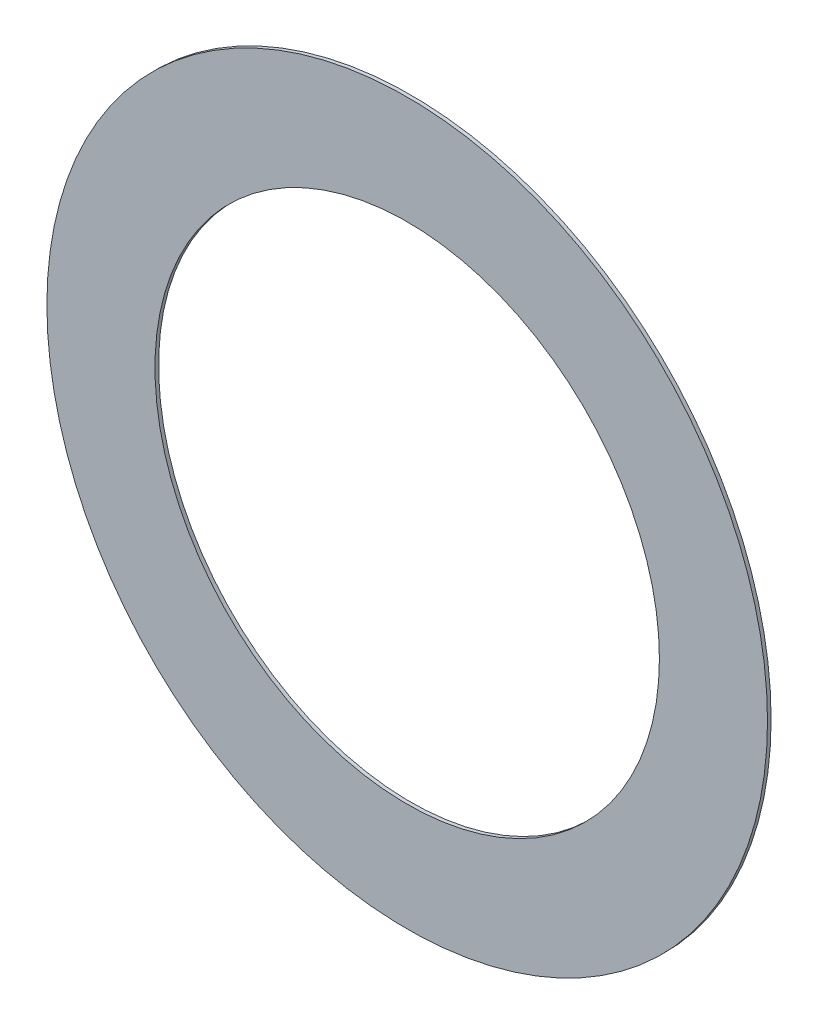
ISO-10303-21;
HEADER;
FILE_DESCRIPTION(('STEP AP214'),'2;1');
FILE_NAME('part.step','',(''),(''),'','','');
FILE_SCHEMA(('AUTOMOTIVE_DESIGN { 1 0 10303 214 1 1 1 1 }'));
ENDSEC;
DATA;
#1=APPLICATION_CONTEXT('core data for automotive mechanical design processes');
#2=APPLICATION_PROTOCOL_DEFINITION('international standard','automotive_design',2000,#1);
#3=PRODUCT_CONTEXT('',#1,'mechanical');
#4=PRODUCT('Part','Part','',(#3));
#5=PRODUCT_RELATED_PRODUCT_CATEGORY('part','',(#4));
#6=PRODUCT_DEFINITION_FORMATION('','',#4);
#7=PRODUCT_DEFINITION_CONTEXT('part definition',#1,'design');
#8=PRODUCT_DEFINITION('design','',#6,#7);
#9=PRODUCT_DEFINITION_SHAPE('','',#8);
#10=(LENGTH_UNIT() NAMED_UNIT(*) SI_UNIT(.MILLI.,.METRE.));
#11=(NAMED_UNIT(*) PLANE_ANGLE_UNIT() SI_UNIT($,.RADIAN.));
#12=(NAMED_UNIT(*) SI_UNIT($,.STERADIAN.) SOLID_ANGLE_UNIT());
#13=UNCERTAINTY_MEASURE_WITH_UNIT(LENGTH_MEASURE(1.E-05),#10,'distance_accuracy_value','');
#14=(GEOMETRIC_REPRESENTATION_CONTEXT(3) GLOBAL_UNCERTAINTY_ASSIGNED_CONTEXT((#13)) GLOBAL_UNIT_ASSIGNED_CONTEXT((#10,
#11,#12)) REPRESENTATION_CONTEXT('',''));
#15=CARTESIAN_POINT('',(0.,0.,0.));
#16=DIRECTION('',(0.,0.,1.));
#17=DIRECTION('',(1.,0.,0.));
#18=AXIS2_PLACEMENT_3D('',#15,#16,#17);
#19=CARTESIAN_POINT('',(0.,0.,0.05));
#20=DIRECTION('',(0.,0.,1.));
#21=DIRECTION('',(1.,0.,0.));
#22=AXIS2_PLACEMENT_3D('',#19,#20,#21);
#23=PLANE('',#22);
#24=CARTESIAN_POINT('',(0.,0.,0.05));
#25=DIRECTION('',(0.,0.,1.));
#26=DIRECTION('',(1.,0.,0.));
#27=AXIS2_PLACEMENT_3D('',#24,#25,#26);
#28=CIRCLE('',#27,10.);
#29=CARTESIAN_POINT('',(10.,0.,0.05));
#30=VERTEX_POINT('',#29);
#31=EDGE_CURVE('E10',#30,#30,#28,.T.);
#32=ORIENTED_EDGE('',*,*,#31,.T.);
#33=EDGE_LOOP('',(#32));
#34=FACE_BOUND('',#33,.T.);
#35=CARTESIAN_POINT('',(0.,0.,0.05));
#36=DIRECTION('',(0.,0.,1.));
#37=DIRECTION('',(1.,0.,0.));
#38=AXIS2_PLACEMENT_3D('',#35,#36,#37);
#39=CIRCLE('',#38,7.);
#40=CARTESIAN_POINT('',(7.,0.,0.05));
#41=VERTEX_POINT('',#40);
#42=EDGE_CURVE('E43',#41,#41,#39,.T.);
#43=ORIENTED_EDGE('',*,*,#42,.F.);
#44=EDGE_LOOP('',(#43));
#45=FACE_BOUND('',#44,.T.);
#46=ADVANCED_FACE('F32',(#34,#45),#23,.T.);
#47=CARTESIAN_POINT('',(0.,0.,-0.05));
#48=DIRECTION('',(0.,0.,1.));
#49=DIRECTION('',(1.,0.,0.));
#50=AXIS2_PLACEMENT_3D('',#47,#48,#49);
#51=PLANE('',#50);
#52=CARTESIAN_POINT('',(0.,0.,-0.05));
#53=DIRECTION('',(0.,0.,1.));
#54=DIRECTION('',(1.,0.,0.));
#55=AXIS2_PLACEMENT_3D('',#52,#53,#54);
#56=CIRCLE('',#55,10.);
#57=CARTESIAN_POINT('',(10.,0.,-0.05));
#58=VERTEX_POINT('',#57);
#59=EDGE_CURVE('E36',#58,#58,#56,.T.);
#60=ORIENTED_EDGE('',*,*,#59,.F.);
#61=EDGE_LOOP('',(#60));
#62=FACE_BOUND('',#61,.T.);
#63=CARTESIAN_POINT('',(0.,0.,-0.05));
#64=DIRECTION('',(0.,0.,1.));
#65=DIRECTION('',(1.,0.,0.));
#66=AXIS2_PLACEMENT_3D('',#63,#64,#65);
#67=CIRCLE('',#66,7.);
#68=CARTESIAN_POINT('',(7.,0.,-0.05));
#69=VERTEX_POINT('',#68);
#70=EDGE_CURVE('E45',#69,#69,#67,.T.);
#71=ORIENTED_EDGE('',*,*,#70,.T.);
#72=EDGE_LOOP('',(#71));
#73=FACE_BOUND('',#72,.T.);
#74=ADVANCED_FACE('F55',(#62,#73),#51,.F.);
#75=CARTESIAN_POINT('',(0.,0.,0.05));
#76=DIRECTION('',(0.,0.,-1.));
#77=DIRECTION('',(-1.,0.,0.));
#78=AXIS2_PLACEMENT_3D('',#75,#76,#77);
#79=CYLINDRICAL_SURFACE('',#78,10.);
#80=ORIENTED_EDGE('',*,*,#31,.F.);
#81=EDGE_LOOP('',(#80));
#82=FACE_BOUND('',#81,.T.);
#83=ORIENTED_EDGE('',*,*,#59,.T.);
#84=EDGE_LOOP('',(#83));
#85=FACE_BOUND('',#84,.T.);
#86=ADVANCED_FACE('F34',(#82,#85),#79,.T.);
#87=CARTESIAN_POINT('',(0.,0.,0.05));
#88=DIRECTION('',(0.,0.,-1.));
#89=DIRECTION('',(-1.,0.,0.));
#90=AXIS2_PLACEMENT_3D('',#87,#88,#89);
#91=CYLINDRICAL_SURFACE('',#90,7.);
#92=ORIENTED_EDGE('',*,*,#42,.T.);
#93=EDGE_LOOP('',(#92));
#94=FACE_BOUND('',#93,.T.);
#95=ORIENTED_EDGE('',*,*,#70,.F.);
#96=EDGE_LOOP('',(#95));
#97=FACE_BOUND('',#96,.T.);
#98=ADVANCED_FACE('F51',(#94,#97),#91,.F.);
#99=CLOSED_SHELL('',(#46,#74,#86,#98));
#100=MANIFOLD_SOLID_BREP('B2',#99);
#101=ADVANCED_BREP_SHAPE_REPRESENTATION('',(#18,#100),#14);
#102=SHAPE_DEFINITION_REPRESENTATION(#9,#101);
ENDSEC;
END-ISO-10303-21;
